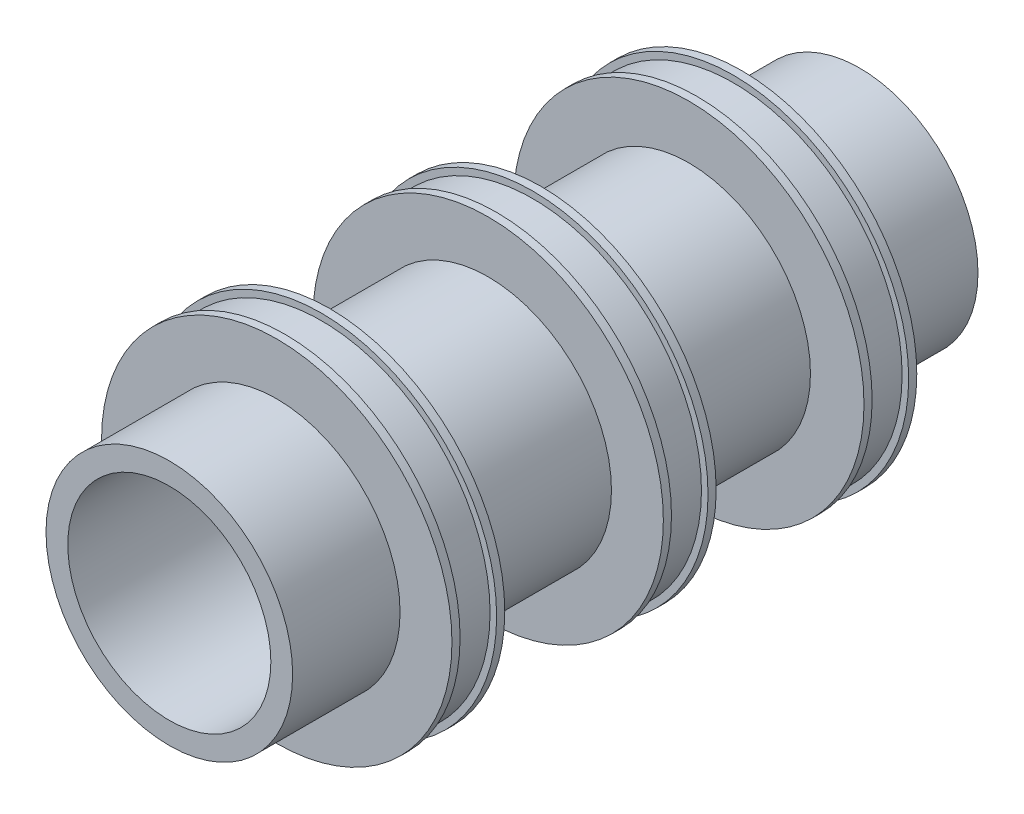
ISO-10303-21;
HEADER;
FILE_DESCRIPTION(('STEP AP214'),'2;1');
FILE_NAME('part.step','',(''),(''),'','','');
FILE_SCHEMA(('AUTOMOTIVE_DESIGN { 1 0 10303 214 1 1 1 1 }'));
ENDSEC;
DATA;
#1=APPLICATION_CONTEXT('core data for automotive mechanical design processes');
#2=APPLICATION_PROTOCOL_DEFINITION('international standard','automotive_design',2000,#1);
#3=PRODUCT_CONTEXT('',#1,'mechanical');
#4=PRODUCT('Part','Part','',(#3));
#5=PRODUCT_RELATED_PRODUCT_CATEGORY('part','',(#4));
#6=PRODUCT_DEFINITION_FORMATION('','',#4);
#7=PRODUCT_DEFINITION_CONTEXT('part definition',#1,'design');
#8=PRODUCT_DEFINITION('design','',#6,#7);
#9=PRODUCT_DEFINITION_SHAPE('','',#8);
#10=(LENGTH_UNIT() NAMED_UNIT(*) SI_UNIT(.MILLI.,.METRE.));
#11=(NAMED_UNIT(*) PLANE_ANGLE_UNIT() SI_UNIT($,.RADIAN.));
#12=(NAMED_UNIT(*) SI_UNIT($,.STERADIAN.) SOLID_ANGLE_UNIT());
#13=UNCERTAINTY_MEASURE_WITH_UNIT(LENGTH_MEASURE(1.E-05),#10,'distance_accuracy_value','');
#14=(GEOMETRIC_REPRESENTATION_CONTEXT(3) GLOBAL_UNCERTAINTY_ASSIGNED_CONTEXT((#13)) GLOBAL_UNIT_ASSIGNED_CONTEXT((#10,
#11,#12)) REPRESENTATION_CONTEXT('',''));
#15=CARTESIAN_POINT('',(0.,0.,0.));
#16=DIRECTION('',(0.,0.,1.));
#17=DIRECTION('',(1.,0.,0.));
#18=AXIS2_PLACEMENT_3D('',#15,#16,#17);
#19=CARTESIAN_POINT('',(0.,25.,85.));
#20=DIRECTION('',(0.,0.,-1.));
#21=DIRECTION('',(-1.,0.,0.));
#22=AXIS2_PLACEMENT_3D('',#19,#20,#21);
#23=PLANE('',#22);
#24=CARTESIAN_POINT('',(0.,0.,85.));
#25=DIRECTION('',(0.,0.,1.));
#26=DIRECTION('',(1.,0.,0.));
#27=AXIS2_PLACEMENT_3D('',#24,#25,#26);
#28=CIRCLE('',#27,25.);
#29=CARTESIAN_POINT('',(25.,0.,85.));
#30=VERTEX_POINT('',#29);
#31=EDGE_CURVE('E123',#30,#30,#28,.T.);
#32=ORIENTED_EDGE('',*,*,#31,.F.);
#33=EDGE_LOOP('',(#32));
#34=FACE_BOUND('',#33,.T.);
#35=CARTESIAN_POINT('',(0.,0.,85.));
#36=DIRECTION('',(0.,0.,1.));
#37=DIRECTION('',(1.,0.,0.));
#38=AXIS2_PLACEMENT_3D('',#35,#36,#37);
#39=CIRCLE('',#38,30.3639401490459);
#40=CARTESIAN_POINT('',(30.3639401490459,0.,85.));
#41=VERTEX_POINT('',#40);
#42=EDGE_CURVE('E10',#41,#41,#39,.T.);
#43=ORIENTED_EDGE('',*,*,#42,.T.);
#44=EDGE_LOOP('',(#43));
#45=FACE_BOUND('',#44,.T.);
#46=ADVANCED_FACE('F35',(#34,#45),#23,.F.);
#47=CARTESIAN_POINT('',(0.,0.,119.060774983754));
#48=DIRECTION('',(0.,0.,1.));
#49=DIRECTION('',(1.,0.,0.));
#50=AXIS2_PLACEMENT_3D('',#47,#48,#49);
#51=CYLINDRICAL_SURFACE('',#50,30.3639401490459);
#52=ORIENTED_EDGE('',*,*,#42,.F.);
#53=EDGE_LOOP('',(#52));
#54=FACE_BOUND('',#53,.T.);
#55=CARTESIAN_POINT('',(0.,0.,58.5521672669007));
#56=DIRECTION('',(0.,0.,1.));
#57=DIRECTION('',(1.,0.,0.));
#58=AXIS2_PLACEMENT_3D('',#55,#56,#57);
#59=CIRCLE('',#58,30.3639401490459);
#60=CARTESIAN_POINT('',(30.3639401490459,0.,58.5521672669007));
#61=VERTEX_POINT('',#60);
#62=EDGE_CURVE('E41',#61,#61,#59,.T.);
#63=ORIENTED_EDGE('',*,*,#62,.T.);
#64=EDGE_LOOP('',(#63));
#65=FACE_BOUND('',#64,.T.);
#66=ADVANCED_FACE('F130',(#54,#65),#51,.T.);
#67=CARTESIAN_POINT('',(0.,30.3639401490459,58.5521672669007));
#68=DIRECTION('',(0.,0.,-1.));
#69=DIRECTION('',(-1.,0.,0.));
#70=AXIS2_PLACEMENT_3D('',#67,#68,#69);
#71=PLANE('',#70);
#72=ORIENTED_EDGE('',*,*,#62,.F.);
#73=EDGE_LOOP('',(#72));
#74=FACE_BOUND('',#73,.T.);
#75=CARTESIAN_POINT('',(0.,0.,58.5521672669007));
#76=DIRECTION('',(0.,0.,1.));
#77=DIRECTION('',(1.,0.,0.));
#78=AXIS2_PLACEMENT_3D('',#75,#76,#77);
#79=CIRCLE('',#78,43.1441534681462);
#80=CARTESIAN_POINT('',(43.1441534681462,0.,58.5521672669007));
#81=VERTEX_POINT('',#80);
#82=EDGE_CURVE('E45',#81,#81,#79,.T.);
#83=ORIENTED_EDGE('',*,*,#82,.T.);
#84=EDGE_LOOP('',(#83));
#85=FACE_BOUND('',#84,.T.);
#86=ADVANCED_FACE('F134',(#74,#85),#71,.F.);
#87=CARTESIAN_POINT('',(0.,0.,119.060774983754));
#88=DIRECTION('',(0.,0.,1.));
#89=DIRECTION('',(1.,0.,0.));
#90=AXIS2_PLACEMENT_3D('',#87,#88,#89);
#91=CYLINDRICAL_SURFACE('',#90,43.1441534681462);
#92=ORIENTED_EDGE('',*,*,#82,.F.);
#93=EDGE_LOOP('',(#92));
#94=FACE_BOUND('',#93,.T.);
#95=CARTESIAN_POINT('',(0.,0.,56.5521672669007));
#96=DIRECTION('',(0.,0.,1.));
#97=DIRECTION('',(1.,0.,0.));
#98=AXIS2_PLACEMENT_3D('',#95,#96,#97);
#99=CIRCLE('',#98,43.1441534681462);
#100=CARTESIAN_POINT('',(43.1441534681462,0.,56.5521672669007));
#101=VERTEX_POINT('',#100);
#102=EDGE_CURVE('E49',#101,#101,#99,.T.);
#103=ORIENTED_EDGE('',*,*,#102,.T.);
#104=EDGE_LOOP('',(#103));
#105=FACE_BOUND('',#104,.T.);
#106=ADVANCED_FACE('F139',(#94,#105),#91,.T.);
#107=CARTESIAN_POINT('',(0.,43.1441534681462,56.5521672669007));
#108=DIRECTION('',(0.,0.,1.));
#109=DIRECTION('',(1.,0.,0.));
#110=AXIS2_PLACEMENT_3D('',#107,#108,#109);
#111=PLANE('',#110);
#112=ORIENTED_EDGE('',*,*,#102,.F.);
#113=EDGE_LOOP('',(#112));
#114=FACE_BOUND('',#113,.T.);
#115=CARTESIAN_POINT('',(0.,0.,56.5521672669007));
#116=DIRECTION('',(0.,0.,1.));
#117=DIRECTION('',(1.,0.,0.));
#118=AXIS2_PLACEMENT_3D('',#115,#116,#117);
#119=CIRCLE('',#118,41.5300018691434);
#120=CARTESIAN_POINT('',(41.5300018691434,0.,56.5521672669007));
#121=VERTEX_POINT('',#120);
#122=EDGE_CURVE('E54',#121,#121,#119,.T.);
#123=ORIENTED_EDGE('',*,*,#122,.T.);
#124=EDGE_LOOP('',(#123));
#125=FACE_BOUND('',#124,.T.);
#126=ADVANCED_FACE('F145',(#114,#125),#111,.F.);
#127=CARTESIAN_POINT('',(0.,0.,119.060774983754));
#128=DIRECTION('',(0.,0.,1.));
#129=DIRECTION('',(1.,0.,0.));
#130=AXIS2_PLACEMENT_3D('',#127,#128,#129);
#131=CYLINDRICAL_SURFACE('',#130,41.5300018691434);
#132=ORIENTED_EDGE('',*,*,#122,.F.);
#133=EDGE_LOOP('',(#132));
#134=FACE_BOUND('',#133,.T.);
#135=CARTESIAN_POINT('',(0.,0.,47.5521672669007));
#136=DIRECTION('',(0.,0.,1.));
#137=DIRECTION('',(1.,0.,0.));
#138=AXIS2_PLACEMENT_3D('',#135,#136,#137);
#139=CIRCLE('',#138,41.5300018691434);
#140=CARTESIAN_POINT('',(41.5300018691434,0.,47.5521672669007));
#141=VERTEX_POINT('',#140);
#142=EDGE_CURVE('E57',#141,#141,#139,.T.);
#143=ORIENTED_EDGE('',*,*,#142,.T.);
#144=EDGE_LOOP('',(#143));
#145=FACE_BOUND('',#144,.T.);
#146=ADVANCED_FACE('F149',(#134,#145),#131,.T.);
#147=CARTESIAN_POINT('',(0.,41.5300018691434,47.5521672669007));
#148=DIRECTION('',(0.,0.,-1.));
#149=DIRECTION('',(-1.,0.,0.));
#150=AXIS2_PLACEMENT_3D('',#147,#148,#149);
#151=PLANE('',#150);
#152=ORIENTED_EDGE('',*,*,#142,.F.);
#153=EDGE_LOOP('',(#152));
#154=FACE_BOUND('',#153,.T.);
#155=CARTESIAN_POINT('',(0.,0.,47.5521672669007));
#156=DIRECTION('',(0.,0.,1.));
#157=DIRECTION('',(1.,0.,0.));
#158=AXIS2_PLACEMENT_3D('',#155,#156,#157);
#159=CIRCLE('',#158,43.1441534681462);
#160=CARTESIAN_POINT('',(43.1441534681462,0.,47.5521672669007));
#161=VERTEX_POINT('',#160);
#162=EDGE_CURVE('E60',#161,#161,#159,.T.);
#163=ORIENTED_EDGE('',*,*,#162,.T.);
#164=EDGE_LOOP('',(#163));
#165=FACE_BOUND('',#164,.T.);
#166=ADVANCED_FACE('F153',(#154,#165),#151,.F.);
#167=CARTESIAN_POINT('',(0.,0.,119.060774983754));
#168=DIRECTION('',(0.,0.,1.));
#169=DIRECTION('',(1.,0.,0.));
#170=AXIS2_PLACEMENT_3D('',#167,#168,#169);
#171=CYLINDRICAL_SURFACE('',#170,43.1441534681462);
#172=ORIENTED_EDGE('',*,*,#162,.F.);
#173=EDGE_LOOP('',(#172));
#174=FACE_BOUND('',#173,.T.);
#175=CARTESIAN_POINT('',(0.,0.,45.5521672669007));
#176=DIRECTION('',(0.,0.,1.));
#177=DIRECTION('',(1.,0.,0.));
#178=AXIS2_PLACEMENT_3D('',#175,#176,#177);
#179=CIRCLE('',#178,43.1441534681462);
#180=CARTESIAN_POINT('',(43.1441534681462,0.,45.5521672669007));
#181=VERTEX_POINT('',#180);
#182=EDGE_CURVE('E63',#181,#181,#179,.T.);
#183=ORIENTED_EDGE('',*,*,#182,.T.);
#184=EDGE_LOOP('',(#183));
#185=FACE_BOUND('',#184,.T.);
#186=ADVANCED_FACE('F157',(#174,#185),#171,.T.);
#187=CARTESIAN_POINT('',(0.,43.1441534681462,45.5521672669007));
#188=DIRECTION('',(0.,0.,1.));
#189=DIRECTION('',(1.,0.,0.));
#190=AXIS2_PLACEMENT_3D('',#187,#188,#189);
#191=PLANE('',#190);
#192=ORIENTED_EDGE('',*,*,#182,.F.);
#193=EDGE_LOOP('',(#192));
#194=FACE_BOUND('',#193,.T.);
#195=CARTESIAN_POINT('',(0.,0.,45.5521672669007));
#196=DIRECTION('',(0.,0.,1.));
#197=DIRECTION('',(1.,0.,0.));
#198=AXIS2_PLACEMENT_3D('',#195,#196,#197);
#199=CIRCLE('',#198,30.3639401490459);
#200=CARTESIAN_POINT('',(30.3639401490459,0.,45.5521672669007));
#201=VERTEX_POINT('',#200);
#202=EDGE_CURVE('E66',#201,#201,#199,.T.);
#203=ORIENTED_EDGE('',*,*,#202,.T.);
#204=EDGE_LOOP('',(#203));
#205=FACE_BOUND('',#204,.T.);
#206=ADVANCED_FACE('F161',(#194,#205),#191,.F.);
#207=CARTESIAN_POINT('',(0.,0.,119.060774983754));
#208=DIRECTION('',(0.,0.,1.));
#209=DIRECTION('',(1.,0.,0.));
#210=AXIS2_PLACEMENT_3D('',#207,#208,#209);
#211=CYLINDRICAL_SURFACE('',#210,30.3639401490459);
#212=ORIENTED_EDGE('',*,*,#202,.F.);
#213=EDGE_LOOP('',(#212));
#214=FACE_BOUND('',#213,.T.);
#215=CARTESIAN_POINT('',(0.,0.,6.49999999999999));
#216=DIRECTION('',(0.,0.,1.));
#217=DIRECTION('',(1.,0.,0.));
#218=AXIS2_PLACEMENT_3D('',#215,#216,#217);
#219=CIRCLE('',#218,30.3639401490459);
#220=CARTESIAN_POINT('',(30.3639401490459,0.,6.49999999999999));
#221=VERTEX_POINT('',#220);
#222=EDGE_CURVE('E69',#221,#221,#219,.T.);
#223=ORIENTED_EDGE('',*,*,#222,.T.);
#224=EDGE_LOOP('',(#223));
#225=FACE_BOUND('',#224,.T.);
#226=ADVANCED_FACE('F165',(#214,#225),#211,.T.);
#227=CARTESIAN_POINT('',(0.,30.3639401490459,6.5));
#228=DIRECTION('',(0.,0.,-1.));
#229=DIRECTION('',(-1.,0.,0.));
#230=AXIS2_PLACEMENT_3D('',#227,#228,#229);
#231=PLANE('',#230);
#232=ORIENTED_EDGE('',*,*,#222,.F.);
#233=EDGE_LOOP('',(#232));
#234=FACE_BOUND('',#233,.T.);
#235=CARTESIAN_POINT('',(0.,0.,6.50000000000001));
#236=DIRECTION('',(0.,0.,1.));
#237=DIRECTION('',(1.,0.,0.));
#238=AXIS2_PLACEMENT_3D('',#235,#236,#237);
#239=CIRCLE('',#238,43.1441534681462);
#240=CARTESIAN_POINT('',(43.1441534681462,0.,6.50000000000001));
#241=VERTEX_POINT('',#240);
#242=EDGE_CURVE('E72',#241,#241,#239,.T.);
#243=ORIENTED_EDGE('',*,*,#242,.T.);
#244=EDGE_LOOP('',(#243));
#245=FACE_BOUND('',#244,.T.);
#246=ADVANCED_FACE('F169',(#234,#245),#231,.F.);
#247=CARTESIAN_POINT('',(0.,0.,119.060774983754));
#248=DIRECTION('',(0.,0.,1.));
#249=DIRECTION('',(1.,0.,0.));
#250=AXIS2_PLACEMENT_3D('',#247,#248,#249);
#251=CYLINDRICAL_SURFACE('',#250,43.1441534681462);
#252=ORIENTED_EDGE('',*,*,#242,.F.);
#253=EDGE_LOOP('',(#252));
#254=FACE_BOUND('',#253,.T.);
#255=CARTESIAN_POINT('',(0.,0.,4.5));
#256=DIRECTION('',(0.,0.,1.));
#257=DIRECTION('',(1.,0.,0.));
#258=AXIS2_PLACEMENT_3D('',#255,#256,#257);
#259=CIRCLE('',#258,43.1441534681462);
#260=CARTESIAN_POINT('',(43.1441534681462,0.,4.5));
#261=VERTEX_POINT('',#260);
#262=EDGE_CURVE('E75',#261,#261,#259,.T.);
#263=ORIENTED_EDGE('',*,*,#262,.T.);
#264=EDGE_LOOP('',(#263));
#265=FACE_BOUND('',#264,.T.);
#266=ADVANCED_FACE('F173',(#254,#265),#251,.T.);
#267=CARTESIAN_POINT('',(0.,43.1441534681462,4.5));
#268=DIRECTION('',(0.,0.,1.));
#269=DIRECTION('',(1.,0.,0.));
#270=AXIS2_PLACEMENT_3D('',#267,#268,#269);
#271=PLANE('',#270);
#272=ORIENTED_EDGE('',*,*,#262,.F.);
#273=EDGE_LOOP('',(#272));
#274=FACE_BOUND('',#273,.T.);
#275=CARTESIAN_POINT('',(0.,0.,4.5));
#276=DIRECTION('',(0.,0.,1.));
#277=DIRECTION('',(1.,0.,0.));
#278=AXIS2_PLACEMENT_3D('',#275,#276,#277);
#279=CIRCLE('',#278,41.5300018691434);
#280=CARTESIAN_POINT('',(41.5300018691434,0.,4.5));
#281=VERTEX_POINT('',#280);
#282=EDGE_CURVE('E78',#281,#281,#279,.T.);
#283=ORIENTED_EDGE('',*,*,#282,.T.);
#284=EDGE_LOOP('',(#283));
#285=FACE_BOUND('',#284,.T.);
#286=ADVANCED_FACE('F177',(#274,#285),#271,.F.);
#287=CARTESIAN_POINT('',(0.,0.,119.060774983754));
#288=DIRECTION('',(0.,0.,1.));
#289=DIRECTION('',(1.,0.,0.));
#290=AXIS2_PLACEMENT_3D('',#287,#288,#289);
#291=CYLINDRICAL_SURFACE('',#290,41.5300018691434);
#292=ORIENTED_EDGE('',*,*,#282,.F.);
#293=EDGE_LOOP('',(#292));
#294=FACE_BOUND('',#293,.T.);
#295=CARTESIAN_POINT('',(0.,0.,-4.5));
#296=DIRECTION('',(0.,0.,1.));
#297=DIRECTION('',(1.,0.,0.));
#298=AXIS2_PLACEMENT_3D('',#295,#296,#297);
#299=CIRCLE('',#298,41.5300018691434);
#300=CARTESIAN_POINT('',(41.5300018691434,0.,-4.5));
#301=VERTEX_POINT('',#300);
#302=EDGE_CURVE('E81',#301,#301,#299,.T.);
#303=ORIENTED_EDGE('',*,*,#302,.T.);
#304=EDGE_LOOP('',(#303));
#305=FACE_BOUND('',#304,.T.);
#306=ADVANCED_FACE('F181',(#294,#305),#291,.T.);
#307=CARTESIAN_POINT('',(0.,41.5300018691434,-4.5));
#308=DIRECTION('',(0.,0.,-1.));
#309=DIRECTION('',(-1.,0.,0.));
#310=AXIS2_PLACEMENT_3D('',#307,#308,#309);
#311=PLANE('',#310);
#312=ORIENTED_EDGE('',*,*,#302,.F.);
#313=EDGE_LOOP('',(#312));
#314=FACE_BOUND('',#313,.T.);
#315=CARTESIAN_POINT('',(0.,0.,-4.5));
#316=DIRECTION('',(0.,0.,1.));
#317=DIRECTION('',(1.,0.,0.));
#318=AXIS2_PLACEMENT_3D('',#315,#316,#317);
#319=CIRCLE('',#318,43.1441534681462);
#320=CARTESIAN_POINT('',(43.1441534681462,0.,-4.5));
#321=VERTEX_POINT('',#320);
#322=EDGE_CURVE('E84',#321,#321,#319,.T.);
#323=ORIENTED_EDGE('',*,*,#322,.T.);
#324=EDGE_LOOP('',(#323));
#325=FACE_BOUND('',#324,.T.);
#326=ADVANCED_FACE('F185',(#314,#325),#311,.F.);
#327=CARTESIAN_POINT('',(0.,0.,119.060774983754));
#328=DIRECTION('',(0.,0.,1.));
#329=DIRECTION('',(1.,0.,0.));
#330=AXIS2_PLACEMENT_3D('',#327,#328,#329);
#331=CYLINDRICAL_SURFACE('',#330,43.1441534681462);
#332=ORIENTED_EDGE('',*,*,#322,.F.);
#333=EDGE_LOOP('',(#332));
#334=FACE_BOUND('',#333,.T.);
#335=CARTESIAN_POINT('',(0.,0.,-6.49999999999999));
#336=DIRECTION('',(0.,0.,1.));
#337=DIRECTION('',(1.,0.,0.));
#338=AXIS2_PLACEMENT_3D('',#335,#336,#337);
#339=CIRCLE('',#338,43.1441534681462);
#340=CARTESIAN_POINT('',(43.1441534681462,0.,-6.49999999999999));
#341=VERTEX_POINT('',#340);
#342=EDGE_CURVE('E87',#341,#341,#339,.T.);
#343=ORIENTED_EDGE('',*,*,#342,.T.);
#344=EDGE_LOOP('',(#343));
#345=FACE_BOUND('',#344,.T.);
#346=ADVANCED_FACE('F189',(#334,#345),#331,.T.);
#347=CARTESIAN_POINT('',(0.,43.1441534681462,-6.5));
#348=DIRECTION('',(0.,0.,1.));
#349=DIRECTION('',(1.,0.,0.));
#350=AXIS2_PLACEMENT_3D('',#347,#348,#349);
#351=PLANE('',#350);
#352=ORIENTED_EDGE('',*,*,#342,.F.);
#353=EDGE_LOOP('',(#352));
#354=FACE_BOUND('',#353,.T.);
#355=CARTESIAN_POINT('',(0.,0.,-6.49999999999999));
#356=DIRECTION('',(0.,0.,1.));
#357=DIRECTION('',(1.,0.,0.));
#358=AXIS2_PLACEMENT_3D('',#355,#356,#357);
#359=CIRCLE('',#358,29.9619405346097);
#360=CARTESIAN_POINT('',(29.9619405346097,0.,-6.49999999999999));
#361=VERTEX_POINT('',#360);
#362=EDGE_CURVE('E90',#361,#361,#359,.T.);
#363=ORIENTED_EDGE('',*,*,#362,.T.);
#364=EDGE_LOOP('',(#363));
#365=FACE_BOUND('',#364,.T.);
#366=ADVANCED_FACE('F193',(#354,#365),#351,.F.);
#367=CARTESIAN_POINT('',(0.,0.,119.060774983754));
#368=DIRECTION('',(0.,0.,1.));
#369=DIRECTION('',(1.,0.,0.));
#370=AXIS2_PLACEMENT_3D('',#367,#368,#369);
#371=CYLINDRICAL_SURFACE('',#370,29.9619405346097);
#372=ORIENTED_EDGE('',*,*,#362,.F.);
#373=EDGE_LOOP('',(#372));
#374=FACE_BOUND('',#373,.T.);
#375=CARTESIAN_POINT('',(0.,0.,-42.9012709719718));
#376=DIRECTION('',(0.,0.,1.));
#377=DIRECTION('',(1.,0.,0.));
#378=AXIS2_PLACEMENT_3D('',#375,#376,#377);
#379=CIRCLE('',#378,29.9619405346097);
#380=CARTESIAN_POINT('',(29.9619405346097,0.,-42.9012709719718));
#381=VERTEX_POINT('',#380);
#382=EDGE_CURVE('E93',#381,#381,#379,.T.);
#383=ORIENTED_EDGE('',*,*,#382,.T.);
#384=EDGE_LOOP('',(#383));
#385=FACE_BOUND('',#384,.T.);
#386=ADVANCED_FACE('F197',(#374,#385),#371,.T.);
#387=CARTESIAN_POINT('',(0.,29.9619405346097,-42.9012709719718));
#388=DIRECTION('',(0.,0.,-1.));
#389=DIRECTION('',(-1.,0.,0.));
#390=AXIS2_PLACEMENT_3D('',#387,#388,#389);
#391=PLANE('',#390);
#392=ORIENTED_EDGE('',*,*,#382,.F.);
#393=EDGE_LOOP('',(#392));
#394=FACE_BOUND('',#393,.T.);
#395=CARTESIAN_POINT('',(0.,0.,-42.9012709719718));
#396=DIRECTION('',(0.,0.,1.));
#397=DIRECTION('',(1.,0.,0.));
#398=AXIS2_PLACEMENT_3D('',#395,#396,#397);
#399=CIRCLE('',#398,43.1441534681462);
#400=CARTESIAN_POINT('',(43.1441534681462,0.,-42.9012709719718));
#401=VERTEX_POINT('',#400);
#402=EDGE_CURVE('E96',#401,#401,#399,.T.);
#403=ORIENTED_EDGE('',*,*,#402,.T.);
#404=EDGE_LOOP('',(#403));
#405=FACE_BOUND('',#404,.T.);
#406=ADVANCED_FACE('F201',(#394,#405),#391,.F.);
#407=CARTESIAN_POINT('',(0.,0.,119.060774983754));
#408=DIRECTION('',(0.,0.,1.));
#409=DIRECTION('',(1.,0.,0.));
#410=AXIS2_PLACEMENT_3D('',#407,#408,#409);
#411=CYLINDRICAL_SURFACE('',#410,43.1441534681462);
#412=ORIENTED_EDGE('',*,*,#402,.F.);
#413=EDGE_LOOP('',(#412));
#414=FACE_BOUND('',#413,.T.);
#415=CARTESIAN_POINT('',(0.,0.,-44.9012709719718));
#416=DIRECTION('',(0.,0.,1.));
#417=DIRECTION('',(1.,0.,0.));
#418=AXIS2_PLACEMENT_3D('',#415,#416,#417);
#419=CIRCLE('',#418,43.1441534681462);
#420=CARTESIAN_POINT('',(43.1441534681462,0.,-44.9012709719718));
#421=VERTEX_POINT('',#420);
#422=EDGE_CURVE('E99',#421,#421,#419,.T.);
#423=ORIENTED_EDGE('',*,*,#422,.T.);
#424=EDGE_LOOP('',(#423));
#425=FACE_BOUND('',#424,.T.);
#426=ADVANCED_FACE('F205',(#414,#425),#411,.T.);
#427=CARTESIAN_POINT('',(0.,43.1441534681462,-44.9012709719718));
#428=DIRECTION('',(0.,0.,1.));
#429=DIRECTION('',(1.,0.,0.));
#430=AXIS2_PLACEMENT_3D('',#427,#428,#429);
#431=PLANE('',#430);
#432=ORIENTED_EDGE('',*,*,#422,.F.);
#433=EDGE_LOOP('',(#432));
#434=FACE_BOUND('',#433,.T.);
#435=CARTESIAN_POINT('',(0.,0.,-44.9012709719718));
#436=DIRECTION('',(0.,0.,1.));
#437=DIRECTION('',(1.,0.,0.));
#438=AXIS2_PLACEMENT_3D('',#435,#436,#437);
#439=CIRCLE('',#438,41.5300018691434);
#440=CARTESIAN_POINT('',(41.5300018691434,0.,-44.9012709719718));
#441=VERTEX_POINT('',#440);
#442=EDGE_CURVE('E102',#441,#441,#439,.T.);
#443=ORIENTED_EDGE('',*,*,#442,.T.);
#444=EDGE_LOOP('',(#443));
#445=FACE_BOUND('',#444,.T.);
#446=ADVANCED_FACE('F209',(#434,#445),#431,.F.);
#447=CARTESIAN_POINT('',(0.,0.,119.060774983754));
#448=DIRECTION('',(0.,0.,1.));
#449=DIRECTION('',(1.,0.,0.));
#450=AXIS2_PLACEMENT_3D('',#447,#448,#449);
#451=CYLINDRICAL_SURFACE('',#450,41.5300018691434);
#452=ORIENTED_EDGE('',*,*,#442,.F.);
#453=EDGE_LOOP('',(#452));
#454=FACE_BOUND('',#453,.T.);
#455=CARTESIAN_POINT('',(0.,0.,-53.9012709719718));
#456=DIRECTION('',(0.,0.,1.));
#457=DIRECTION('',(1.,0.,0.));
#458=AXIS2_PLACEMENT_3D('',#455,#456,#457);
#459=CIRCLE('',#458,41.5300018691434);
#460=CARTESIAN_POINT('',(41.5300018691434,0.,-53.9012709719718));
#461=VERTEX_POINT('',#460);
#462=EDGE_CURVE('E105',#461,#461,#459,.T.);
#463=ORIENTED_EDGE('',*,*,#462,.T.);
#464=EDGE_LOOP('',(#463));
#465=FACE_BOUND('',#464,.T.);
#466=ADVANCED_FACE('F213',(#454,#465),#451,.T.);
#467=CARTESIAN_POINT('',(0.,41.5300018691434,-53.9012709719718));
#468=DIRECTION('',(0.,0.,-1.));
#469=DIRECTION('',(-1.,0.,0.));
#470=AXIS2_PLACEMENT_3D('',#467,#468,#469);
#471=PLANE('',#470);
#472=ORIENTED_EDGE('',*,*,#462,.F.);
#473=EDGE_LOOP('',(#472));
#474=FACE_BOUND('',#473,.T.);
#475=CARTESIAN_POINT('',(0.,0.,-53.9012709719718));
#476=DIRECTION('',(0.,0.,1.));
#477=DIRECTION('',(1.,0.,0.));
#478=AXIS2_PLACEMENT_3D('',#475,#476,#477);
#479=CIRCLE('',#478,43.1441534681462);
#480=CARTESIAN_POINT('',(43.1441534681462,0.,-53.9012709719718));
#481=VERTEX_POINT('',#480);
#482=EDGE_CURVE('E108',#481,#481,#479,.T.);
#483=ORIENTED_EDGE('',*,*,#482,.T.);
#484=EDGE_LOOP('',(#483));
#485=FACE_BOUND('',#484,.T.);
#486=ADVANCED_FACE('F217',(#474,#485),#471,.F.);
#487=CARTESIAN_POINT('',(0.,0.,119.060774983754));
#488=DIRECTION('',(0.,0.,1.));
#489=DIRECTION('',(1.,0.,0.));
#490=AXIS2_PLACEMENT_3D('',#487,#488,#489);
#491=CYLINDRICAL_SURFACE('',#490,43.1441534681462);
#492=ORIENTED_EDGE('',*,*,#482,.F.);
#493=EDGE_LOOP('',(#492));
#494=FACE_BOUND('',#493,.T.);
#495=CARTESIAN_POINT('',(0.,0.,-55.9012709719718));
#496=DIRECTION('',(0.,0.,1.));
#497=DIRECTION('',(1.,0.,0.));
#498=AXIS2_PLACEMENT_3D('',#495,#496,#497);
#499=CIRCLE('',#498,43.1441534681462);
#500=CARTESIAN_POINT('',(43.1441534681462,0.,-55.9012709719718));
#501=VERTEX_POINT('',#500);
#502=EDGE_CURVE('E111',#501,#501,#499,.T.);
#503=ORIENTED_EDGE('',*,*,#502,.T.);
#504=EDGE_LOOP('',(#503));
#505=FACE_BOUND('',#504,.T.);
#506=ADVANCED_FACE('F221',(#494,#505),#491,.T.);
#507=CARTESIAN_POINT('',(0.,43.1441534681462,-55.9012709719718));
#508=DIRECTION('',(0.,0.,1.));
#509=DIRECTION('',(1.,0.,0.));
#510=AXIS2_PLACEMENT_3D('',#507,#508,#509);
#511=PLANE('',#510);
#512=ORIENTED_EDGE('',*,*,#502,.F.);
#513=EDGE_LOOP('',(#512));
#514=FACE_BOUND('',#513,.T.);
#515=CARTESIAN_POINT('',(0.,0.,-55.9012709719718));
#516=DIRECTION('',(0.,0.,1.));
#517=DIRECTION('',(1.,0.,0.));
#518=AXIS2_PLACEMENT_3D('',#515,#516,#517);
#519=CIRCLE('',#518,29.1151750459463);
#520=CARTESIAN_POINT('',(29.1151750459463,0.,-55.9012709719718));
#521=VERTEX_POINT('',#520);
#522=EDGE_CURVE('E114',#521,#521,#519,.T.);
#523=ORIENTED_EDGE('',*,*,#522,.T.);
#524=EDGE_LOOP('',(#523));
#525=FACE_BOUND('',#524,.T.);
#526=ADVANCED_FACE('F225',(#514,#525),#511,.F.);
#527=CARTESIAN_POINT('',(0.,0.,119.060774983754));
#528=DIRECTION('',(0.,0.,1.));
#529=DIRECTION('',(1.,0.,0.));
#530=AXIS2_PLACEMENT_3D('',#527,#528,#529);
#531=CYLINDRICAL_SURFACE('',#530,29.1151750459463);
#532=ORIENTED_EDGE('',*,*,#522,.F.);
#533=EDGE_LOOP('',(#532));
#534=FACE_BOUND('',#533,.T.);
#535=CARTESIAN_POINT('',(0.,0.,-85.));
#536=DIRECTION('',(0.,0.,1.));
#537=DIRECTION('',(1.,0.,0.));
#538=AXIS2_PLACEMENT_3D('',#535,#536,#537);
#539=CIRCLE('',#538,29.1151750459463);
#540=CARTESIAN_POINT('',(29.1151750459463,0.,-85.));
#541=VERTEX_POINT('',#540);
#542=EDGE_CURVE('E117',#541,#541,#539,.T.);
#543=ORIENTED_EDGE('',*,*,#542,.T.);
#544=EDGE_LOOP('',(#543));
#545=FACE_BOUND('',#544,.T.);
#546=ADVANCED_FACE('F229',(#534,#545),#531,.T.);
#547=CARTESIAN_POINT('',(0.,29.1151750459463,-85.));
#548=DIRECTION('',(0.,0.,1.));
#549=DIRECTION('',(1.,0.,0.));
#550=AXIS2_PLACEMENT_3D('',#547,#548,#549);
#551=PLANE('',#550);
#552=ORIENTED_EDGE('',*,*,#542,.F.);
#553=EDGE_LOOP('',(#552));
#554=FACE_BOUND('',#553,.T.);
#555=CARTESIAN_POINT('',(0.,0.,-85.));
#556=DIRECTION('',(0.,0.,1.));
#557=DIRECTION('',(1.,0.,0.));
#558=AXIS2_PLACEMENT_3D('',#555,#556,#557);
#559=CIRCLE('',#558,25.);
#560=CARTESIAN_POINT('',(25.,0.,-85.));
#561=VERTEX_POINT('',#560);
#562=EDGE_CURVE('E120',#561,#561,#559,.T.);
#563=ORIENTED_EDGE('',*,*,#562,.T.);
#564=EDGE_LOOP('',(#563));
#565=FACE_BOUND('',#564,.T.);
#566=ADVANCED_FACE('F233',(#554,#565),#551,.F.);
#567=CARTESIAN_POINT('',(0.,0.,119.060774983754));
#568=DIRECTION('',(0.,0.,1.));
#569=DIRECTION('',(1.,0.,0.));
#570=AXIS2_PLACEMENT_3D('',#567,#568,#569);
#571=CYLINDRICAL_SURFACE('',#570,25.);
#572=ORIENTED_EDGE('',*,*,#562,.F.);
#573=EDGE_LOOP('',(#572));
#574=FACE_BOUND('',#573,.T.);
#575=ORIENTED_EDGE('',*,*,#31,.T.);
#576=EDGE_LOOP('',(#575));
#577=FACE_BOUND('',#576,.T.);
#578=ADVANCED_FACE('F127',(#574,#577),#571,.F.);
#579=CLOSED_SHELL('',(#46,#66,#86,#106,#126,#146,#166,#186,#206,#226,#246,#266,#286,#306,#326,
#346,#366,#386,#406,#426,#446,#466,#486,#506,#526,#546,#566,#578));
#580=MANIFOLD_SOLID_BREP('B2',#579);
#581=ADVANCED_BREP_SHAPE_REPRESENTATION('',(#18,#580),#14);
#582=SHAPE_DEFINITION_REPRESENTATION(#9,#581);
ENDSEC;
END-ISO-10303-21;
